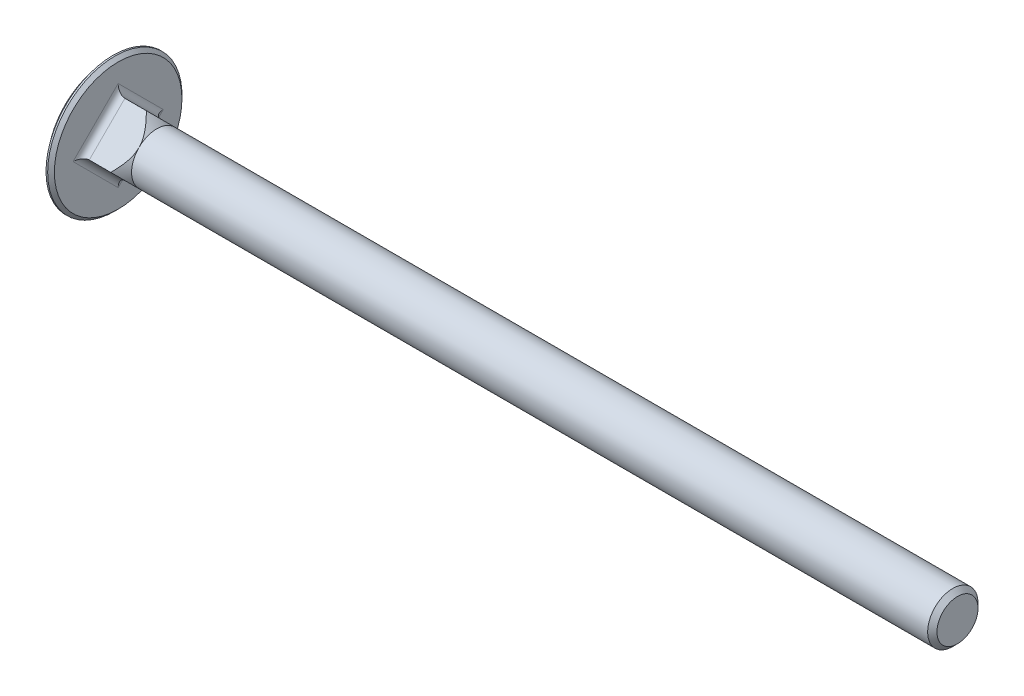
ISO-10303-21;
HEADER;
FILE_DESCRIPTION(('STEP AP214'),'2;1');
FILE_NAME('part.step','',(''),(''),'','','');
FILE_SCHEMA(('AUTOMOTIVE_DESIGN { 1 0 10303 214 1 1 1 1 }'));
ENDSEC;
DATA;
#1=APPLICATION_CONTEXT('core data for automotive mechanical design processes');
#2=APPLICATION_PROTOCOL_DEFINITION('international standard','automotive_design',2000,#1);
#3=PRODUCT_CONTEXT('',#1,'mechanical');
#4=PRODUCT('Part','Part','',(#3));
#5=PRODUCT_RELATED_PRODUCT_CATEGORY('part','',(#4));
#6=PRODUCT_DEFINITION_FORMATION('','',#4);
#7=PRODUCT_DEFINITION_CONTEXT('part definition',#1,'design');
#8=PRODUCT_DEFINITION('design','',#6,#7);
#9=PRODUCT_DEFINITION_SHAPE('','',#8);
#10=(LENGTH_UNIT() NAMED_UNIT(*) SI_UNIT(.MILLI.,.METRE.));
#11=(NAMED_UNIT(*) PLANE_ANGLE_UNIT() SI_UNIT($,.RADIAN.));
#12=(NAMED_UNIT(*) SI_UNIT($,.STERADIAN.) SOLID_ANGLE_UNIT());
#13=UNCERTAINTY_MEASURE_WITH_UNIT(LENGTH_MEASURE(1.E-05),#10,'distance_accuracy_value','');
#14=(GEOMETRIC_REPRESENTATION_CONTEXT(3) GLOBAL_UNCERTAINTY_ASSIGNED_CONTEXT((#13)) GLOBAL_UNIT_ASSIGNED_CONTEXT((#10,
#11,#12)) REPRESENTATION_CONTEXT('',''));
#15=CARTESIAN_POINT('',(0.,0.,0.));
#16=DIRECTION('',(0.,0.,1.));
#17=DIRECTION('',(1.,0.,0.));
#18=AXIS2_PLACEMENT_3D('',#15,#16,#17);
#19=CARTESIAN_POINT('',(-31.75,0.,0.));
#20=DIRECTION('',(-1.,0.,0.));
#21=DIRECTION('',(0.,0.,1.));
#22=AXIS2_PLACEMENT_3D('',#19,#20,#21);
#23=CYLINDRICAL_SURFACE('',#22,2.99999999999999);
#24=CARTESIAN_POINT('',(8.2,0.,0.));
#25=DIRECTION('',(-1.,0.,0.));
#26=DIRECTION('',(0.,0.,1.));
#27=AXIS2_PLACEMENT_3D('',#24,#25,#26);
#28=CIRCLE('',#27,2.99999999999999);
#29=CARTESIAN_POINT('',(8.2,2.12132034355964,2.12132034355964));
#30=VERTEX_POINT('',#29);
#31=CARTESIAN_POINT('',(8.2,-2.12132034355964,2.12132034355964));
#32=VERTEX_POINT('',#31);
#33=EDGE_CURVE('E122',#30,#32,#28,.F.);
#34=ORIENTED_EDGE('',*,*,#33,.T.);
#35=CARTESIAN_POINT('',(8.2,-2.12132034355964,-2.12132034355964));
#36=VERTEX_POINT('',#35);
#37=EDGE_CURVE('E131',#32,#36,#28,.F.);
#38=ORIENTED_EDGE('',*,*,#37,.T.);
#39=CARTESIAN_POINT('',(8.2,2.12132034355964,-2.12132034355964));
#40=VERTEX_POINT('',#39);
#41=EDGE_CURVE('E134',#36,#40,#28,.F.);
#42=ORIENTED_EDGE('',*,*,#41,.T.);
#43=EDGE_CURVE('E108',#40,#30,#28,.F.);
#44=ORIENTED_EDGE('',*,*,#43,.T.);
#45=EDGE_LOOP('',(#34,#38,#42,#44));
#46=FACE_BOUND('',#45,.T.);
#47=CARTESIAN_POINT('',(103.0455,0.,0.));
#48=DIRECTION('',(-1.,0.,0.));
#49=DIRECTION('',(0.,0.,1.));
#50=AXIS2_PLACEMENT_3D('',#47,#48,#49);
#51=CIRCLE('',#50,2.99999999999998);
#52=CARTESIAN_POINT('',(103.0455,0.,2.99999999999998));
#53=VERTEX_POINT('',#52);
#54=EDGE_CURVE('E259',#53,#53,#51,.T.);
#55=ORIENTED_EDGE('',*,*,#54,.T.);
#56=EDGE_LOOP('',(#55));
#57=FACE_BOUND('',#56,.T.);
#58=ADVANCED_FACE('F36',(#46,#57),#23,.T.);
#59=CARTESIAN_POINT('',(103.6,2.4455,0.));
#60=DIRECTION('',(1.,0.,0.));
#61=DIRECTION('',(0.,0.,-1.));
#62=AXIS2_PLACEMENT_3D('',#59,#60,#61);
#63=PLANE('',#62);
#64=CARTESIAN_POINT('',(103.6,0.,0.));
#65=DIRECTION('',(-1.,0.,0.));
#66=DIRECTION('',(0.,0.,1.));
#67=AXIS2_PLACEMENT_3D('',#64,#65,#66);
#68=CIRCLE('',#67,2.4455);
#69=CARTESIAN_POINT('',(103.6,0.,2.4455));
#70=VERTEX_POINT('',#69);
#71=EDGE_CURVE('E129',#70,#70,#68,.T.);
#72=ORIENTED_EDGE('',*,*,#71,.F.);
#73=EDGE_LOOP('',(#72));
#74=FACE_BOUND('',#73,.T.);
#75=ADVANCED_FACE('F193',(#74),#63,.T.);
#76=CARTESIAN_POINT('',(103.6,0.,0.));
#77=DIRECTION('',(-1.,0.,0.));
#78=DIRECTION('',(0.,0.,1.));
#79=AXIS2_PLACEMENT_3D('',#76,#77,#78);
#80=CONICAL_SURFACE('',#79,2.4455,0.785398163397422);
#81=ORIENTED_EDGE('',*,*,#54,.F.);
#82=EDGE_LOOP('',(#81));
#83=FACE_BOUND('',#82,.T.);
#84=ORIENTED_EDGE('',*,*,#71,.T.);
#85=EDGE_LOOP('',(#84));
#86=FACE_BOUND('',#85,.T.);
#87=ADVANCED_FACE('F198',(#83,#86),#80,.T.);
#88=CARTESIAN_POINT('',(2.20000000000002,0.,0.));
#89=DIRECTION('',(-1.,0.,0.));
#90=DIRECTION('',(0.,0.,1.));
#91=AXIS2_PLACEMENT_3D('',#88,#89,#90);
#92=CONICAL_SURFACE('',#91,9.,0.78539816339745);
#93=CARTESIAN_POINT('',(6.95715930816689,4.24284068711929,-0.000199999999999571));
#94=CARTESIAN_POINT('',(7.01643460291272,4.18354884947332,0.0590918376459672));
#95=CARTESIAN_POINT('',(7.07491232269781,4.123849261009,0.118791426110286));
#96=CARTESIAN_POINT('',(7.18989092946537,4.00346812939192,0.239172557727362));
#97=CARTESIAN_POINT('',(7.24639091590675,3.94278615684913,0.299854530270156));
#98=CARTESIAN_POINT('',(7.35766892755164,3.81956214384989,0.423078543269395));
#99=CARTESIAN_POINT('',(7.41241663337786,3.75700633775018,0.485634349369109));
#100=CARTESIAN_POINT('',(7.51886023106645,3.63061648575001,0.612024201369276));
#101=CARTESIAN_POINT('',(7.57055647160103,3.56678258700996,0.675858100109321));
#102=CARTESIAN_POINT('',(7.67174666983998,3.43562527527377,0.807015411845515));
#103=CARTESIAN_POINT('',(7.72112124590263,3.36825515972747,0.874385527391819));
#104=CARTESIAN_POINT('',(7.81485548466575,3.23180100313267,1.01083968398662));
#105=CARTESIAN_POINT('',(7.85921419481978,3.16271663956453,1.07992404755475));
#106=CARTESIAN_POINT('',(7.98248355046365,2.95331308578628,1.289327601333));
#107=CARTESIAN_POINT('',(8.05222972729531,2.81005176209045,1.43258892502884));
#108=CARTESIAN_POINT('',(8.12780049193547,2.59430729463026,1.64833339248902));
#109=CARTESIAN_POINT('',(8.14794262242049,2.52430014494078,1.7183405421785));
#110=CARTESIAN_POINT('',(8.17882887308437,2.38321062880929,1.85943005831));
#111=CARTESIAN_POINT('',(8.18957094130362,2.3121280310487,1.93051265607058));
#112=CARTESIAN_POINT('',(8.2008334522612,2.17055574380496,2.07208494331433));
#113=CARTESIAN_POINT('',(8.20149522498811,2.10007173273608,2.1425689543832));
#114=CARTESIAN_POINT('',(8.19291620035083,1.95941037804252,2.28323030907676));
#115=CARTESIAN_POINT('',(8.18367535606004,1.88923303587267,2.35340765124662));
#116=CARTESIAN_POINT('',(8.15600584917316,1.75030558303287,2.49233510408642));
#117=CARTESIAN_POINT('',(8.13764150446671,1.68154894205988,2.56109174505941));
#118=CARTESIAN_POINT('',(8.09279890784268,1.54534927741958,2.69729140969971));
#119=CARTESIAN_POINT('',(8.06631574532425,1.47790707510901,2.76473361201027));
#120=CARTESIAN_POINT('',(8.00608482010148,1.34372760816381,2.89891307895547));
#121=CARTESIAN_POINT('',(7.97224787918966,1.27701061273304,2.96563007438625));
#122=CARTESIAN_POINT('',(7.89876080414648,1.14522797402158,3.0974127130977));
#123=CARTESIAN_POINT('',(7.85911151529404,1.08016209223388,3.16247859488541));
#124=CARTESIAN_POINT('',(7.75757568127071,0.924792870769788,3.3178478163495));
#125=CARTESIAN_POINT('',(7.69330756858018,0.835271153647686,3.4073695334716));
#126=CARTESIAN_POINT('',(7.55770456538748,0.658912920654168,3.58372776646512));
#127=CARTESIAN_POINT('',(7.48636507333269,0.572078202151462,3.67056248496782));
#128=CARTESIAN_POINT('',(7.34065654968733,0.403299846098274,3.83934084102101));
#129=CARTESIAN_POINT('',(7.26644512123752,0.321287746779483,3.9213529403398));
#130=CARTESIAN_POINT('',(7.15234645891491,0.199689955696817,4.04295073142247));
#131=CARTESIAN_POINT('',(7.11388489137572,0.159428733989405,4.08321195312988));
#132=CARTESIAN_POINT('',(7.03612441479246,0.0793171961942268,4.16332349092506));
#133=CARTESIAN_POINT('',(6.99682557385314,0.0394668470739558,4.20317384004533));
#134=CARTESIAN_POINT('',(6.95715930816689,-0.00020000000000077,4.24284068711929));
#135=B_SPLINE_CURVE_WITH_KNOTS('',3,(#93,#94,#95,#96,#97,#98,#99,#100,#101,#102,#103,#104,#105,
#106,#107,#108,#109,#110,#111,#112,#113,#114,#115,#116,#117,#118,#119,#120,#121,#122,#123,#124,
#125,#126,#127,#128,#129,#130,#131,#132,#133,#134),.UNSPECIFIED.,.F.,.F.,(4,2,2,2,2,2,2,2,2,2,2,
2,2,2,2,2,2,2,2,2,4),(0.,0.308071452286483,0.616281403837969,0.928340708616832,1.24036428699253,
1.56214294853695,1.88398261573137,2.52380770468371,2.82653854831693,3.1293354592375,
3.42788305930369,3.72643207413549,4.02290565428026,4.31955890903334,4.62003321839452,
4.92046387360824,5.3460850582516,5.77198504828632,6.18496220263305,6.39108995770356,
6.59720100964495),.UNSPECIFIED.);
#136=CARTESIAN_POINT('',(6.95735931288072,0.,4.24264068711929));
#137=VERTEX_POINT('',#136);
#138=EDGE_CURVE('E117',#30,#137,#135,.T.);
#139=ORIENTED_EDGE('',*,*,#138,.T.);
#140=CARTESIAN_POINT('',(6.95715930816689,0.000199999999999906,4.24284068711929));
#141=CARTESIAN_POINT('',(7.01643460291272,-0.0590918376459671,4.18354884947332));
#142=CARTESIAN_POINT('',(7.07491232269781,-0.118791426110286,4.123849261009));
#143=CARTESIAN_POINT('',(7.18989092946537,-0.239172557727362,4.00346812939192));
#144=CARTESIAN_POINT('',(7.24639091590675,-0.299854530270155,3.94278615684913));
#145=CARTESIAN_POINT('',(7.35766892755164,-0.423078543269395,3.81956214384989));
#146=CARTESIAN_POINT('',(7.41241663337786,-0.485634349369109,3.75700633775018));
#147=CARTESIAN_POINT('',(7.51886023106644,-0.612024201369276,3.63061648575001));
#148=CARTESIAN_POINT('',(7.57055647160103,-0.675858100109322,3.56678258700996));
#149=CARTESIAN_POINT('',(7.67174666983998,-0.807015411845515,3.43562527527377));
#150=CARTESIAN_POINT('',(7.72112124590263,-0.874385527391819,3.36825515972747));
#151=CARTESIAN_POINT('',(7.81485548466575,-1.01083968398662,3.23180100313266));
#152=CARTESIAN_POINT('',(7.85921419481978,-1.07992404755475,3.16271663956453));
#153=CARTESIAN_POINT('',(7.98248355046365,-1.289327601333,2.95331308578628));
#154=CARTESIAN_POINT('',(8.05222972729531,-1.43258892502884,2.81005176209045));
#155=CARTESIAN_POINT('',(8.12780049193547,-1.64833339248902,2.59430729463026));
#156=CARTESIAN_POINT('',(8.14794262242049,-1.7183405421785,2.52430014494078));
#157=CARTESIAN_POINT('',(8.17882887308437,-1.85943005831,2.38321062880929));
#158=CARTESIAN_POINT('',(8.18957094130362,-1.93051265607058,2.3121280310487));
#159=CARTESIAN_POINT('',(8.2008334522612,-2.07208494331433,2.17055574380496));
#160=CARTESIAN_POINT('',(8.20149522498811,-2.1425689543832,2.10007173273608));
#161=CARTESIAN_POINT('',(8.19291620035083,-2.28323030907676,1.95941037804252));
#162=CARTESIAN_POINT('',(8.18367535606004,-2.35340765124662,1.88923303587267));
#163=CARTESIAN_POINT('',(8.15600584917316,-2.49233510408642,1.75030558303287));
#164=CARTESIAN_POINT('',(8.13764150446671,-2.56109174505941,1.68154894205988));
#165=CARTESIAN_POINT('',(8.09279890784268,-2.69729140969971,1.54534927741958));
#166=CARTESIAN_POINT('',(8.06631574532425,-2.76473361201027,1.47790707510901));
#167=CARTESIAN_POINT('',(8.00608482010148,-2.89891307895547,1.34372760816382));
#168=CARTESIAN_POINT('',(7.97224787918966,-2.96563007438625,1.27701061273304));
#169=CARTESIAN_POINT('',(7.89876080414648,-3.0974127130977,1.14522797402158));
#170=CARTESIAN_POINT('',(7.85911151529404,-3.16247859488541,1.08016209223388));
#171=CARTESIAN_POINT('',(7.75757568127071,-3.3178478163495,0.924792870769789));
#172=CARTESIAN_POINT('',(7.69330756858018,-3.4073695334716,0.835271153647687));
#173=CARTESIAN_POINT('',(7.55770456538749,-3.58372776646512,0.658912920654169));
#174=CARTESIAN_POINT('',(7.48636507333269,-3.67056248496782,0.572078202151462));
#175=CARTESIAN_POINT('',(7.34065654968733,-3.83934084102101,0.403299846098275));
#176=CARTESIAN_POINT('',(7.26644512123752,-3.9213529403398,0.321287746779484));
#177=CARTESIAN_POINT('',(7.15234645891491,-4.04295073142247,0.199689955696818));
#178=CARTESIAN_POINT('',(7.11388489137572,-4.08321195312988,0.159428733989406));
#179=CARTESIAN_POINT('',(7.03612441479246,-4.16332349092506,0.0793171961942277));
#180=CARTESIAN_POINT('',(6.99682557385314,-4.20317384004533,0.0394668470739564));
#181=CARTESIAN_POINT('',(6.95715930816689,-4.24284068711929,-0.000199999999999621));
#182=B_SPLINE_CURVE_WITH_KNOTS('',3,(#140,#141,#142,#143,#144,#145,#146,#147,#148,#149,#150,
#151,#152,#153,#154,#155,#156,#157,#158,#159,#160,#161,#162,#163,#164,#165,#166,#167,#168,#169,
#170,#171,#172,#173,#174,#175,#176,#177,#178,#179,#180,#181),.UNSPECIFIED.,.F.,.F.,(4,2,2,2,2,2,
2,2,2,2,2,2,2,2,2,2,2,2,2,2,4),(0.,0.308071452286484,0.61628140383797,0.928340708616833,
1.24036428699253,1.56214294853696,1.88398261573137,2.52380770468371,2.82653854831693,
3.1293354592375,3.42788305930369,3.72643207413549,4.02290565428026,4.31955890903334,
4.62003321839452,4.92046387360824,5.34608505825161,5.77198504828632,6.18496220263305,
6.39108995770356,6.59720100964495),.UNSPECIFIED.);
#183=EDGE_CURVE('E125',#137,#32,#182,.T.);
#184=ORIENTED_EDGE('',*,*,#183,.T.);
#185=ORIENTED_EDGE('',*,*,#33,.F.);
#186=EDGE_LOOP('',(#139,#184,#185));
#187=FACE_BOUND('',#186,.T.);
#188=ADVANCED_FACE('F123',(#187),#92,.T.);
#189=CARTESIAN_POINT('',(6.95735931288072,4.24264068711929,0.));
#190=VERTEX_POINT('',#189);
#191=EDGE_CURVE('E104',#190,#30,#135,.T.);
#192=ORIENTED_EDGE('',*,*,#191,.T.);
#193=ORIENTED_EDGE('',*,*,#43,.F.);
#194=CARTESIAN_POINT('',(6.95715930816689,-0.000200000000000094,-4.24284068711929));
#195=CARTESIAN_POINT('',(7.01643460291272,0.0590918376459666,-4.18354884947332));
#196=CARTESIAN_POINT('',(7.07491232269781,0.118791426110285,-4.123849261009));
#197=CARTESIAN_POINT('',(7.18989092946537,0.239172557727361,-4.00346812939192));
#198=CARTESIAN_POINT('',(7.24639091590675,0.299854530270155,-3.94278615684913));
#199=CARTESIAN_POINT('',(7.35766892755164,0.423078543269394,-3.81956214384989));
#200=CARTESIAN_POINT('',(7.41241663337786,0.485634349369109,-3.75700633775018));
#201=CARTESIAN_POINT('',(7.51886023106645,0.612024201369276,-3.63061648575001));
#202=CARTESIAN_POINT('',(7.57055647160103,0.675858100109321,-3.56678258700996));
#203=CARTESIAN_POINT('',(7.67174666983998,0.807015411845515,-3.43562527527377));
#204=CARTESIAN_POINT('',(7.72112124590263,0.874385527391819,-3.36825515972747));
#205=CARTESIAN_POINT('',(7.81485548466575,1.01083968398662,-3.23180100313267));
#206=CARTESIAN_POINT('',(7.85921419481978,1.07992404755475,-3.16271663956453));
#207=CARTESIAN_POINT('',(7.98248355046365,1.289327601333,-2.95331308578628));
#208=CARTESIAN_POINT('',(8.05222972729531,1.43258892502884,-2.81005176209045));
#209=CARTESIAN_POINT('',(8.12780049193547,1.64833339248902,-2.59430729463026));
#210=CARTESIAN_POINT('',(8.14794262242049,1.7183405421785,-2.52430014494078));
#211=CARTESIAN_POINT('',(8.17882887308437,1.85943005831,-2.38321062880929));
#212=CARTESIAN_POINT('',(8.18957094130362,1.93051265607058,-2.3121280310487));
#213=CARTESIAN_POINT('',(8.2008334522612,2.07208494331433,-2.17055574380496));
#214=CARTESIAN_POINT('',(8.20149522498811,2.1425689543832,-2.10007173273608));
#215=CARTESIAN_POINT('',(8.19291620035083,2.28323030907676,-1.95941037804252));
#216=CARTESIAN_POINT('',(8.18367535606004,2.35340765124662,-1.88923303587267));
#217=CARTESIAN_POINT('',(8.15600584917316,2.49233510408642,-1.75030558303287));
#218=CARTESIAN_POINT('',(8.13764150446671,2.56109174505941,-1.68154894205988));
#219=CARTESIAN_POINT('',(8.09279890784268,2.69729140969971,-1.54534927741958));
#220=CARTESIAN_POINT('',(8.06631574532425,2.76473361201027,-1.47790707510901));
#221=CARTESIAN_POINT('',(8.00608482010149,2.89891307895547,-1.34372760816381));
#222=CARTESIAN_POINT('',(7.97224787918966,2.96563007438625,-1.27701061273304));
#223=CARTESIAN_POINT('',(7.89876080414648,3.0974127130977,-1.14522797402158));
#224=CARTESIAN_POINT('',(7.85911151529403,3.16247859488541,-1.08016209223388));
#225=CARTESIAN_POINT('',(7.75757568127071,3.3178478163495,-0.924792870769789));
#226=CARTESIAN_POINT('',(7.69330756858018,3.4073695334716,-0.835271153647686));
#227=CARTESIAN_POINT('',(7.55770456538748,3.58372776646512,-0.658912920654168));
#228=CARTESIAN_POINT('',(7.48636507333269,3.67056248496782,-0.572078202151461));
#229=CARTESIAN_POINT('',(7.34065654968733,3.83934084102101,-0.403299846098274));
#230=CARTESIAN_POINT('',(7.26644512123752,3.9213529403398,-0.321287746779484));
#231=CARTESIAN_POINT('',(7.15234645891491,4.04295073142247,-0.199689955696818));
#232=CARTESIAN_POINT('',(7.11388489137572,4.08321195312988,-0.159428733989406));
#233=CARTESIAN_POINT('',(7.03612441479246,4.16332349092506,-0.0793171961942274));
#234=CARTESIAN_POINT('',(6.99682557385314,4.20317384004533,-0.0394668470739563));
#235=CARTESIAN_POINT('',(6.95715930816689,4.24284068711929,0.000199999999999894));
#236=B_SPLINE_CURVE_WITH_KNOTS('',3,(#194,#195,#196,#197,#198,#199,#200,#201,#202,#203,#204,
#205,#206,#207,#208,#209,#210,#211,#212,#213,#214,#215,#216,#217,#218,#219,#220,#221,#222,#223,
#224,#225,#226,#227,#228,#229,#230,#231,#232,#233,#234,#235),.UNSPECIFIED.,.F.,.F.,(4,2,2,2,2,2,
2,2,2,2,2,2,2,2,2,2,2,2,2,2,4),(0.,0.308071452286483,0.616281403837969,0.928340708616832,
1.24036428699253,1.56214294853696,1.88398261573137,2.52380770468371,2.82653854831693,
3.1293354592375,3.42788305930369,3.72643207413549,4.02290565428026,4.31955890903334,
4.62003321839452,4.92046387360824,5.34608505825161,5.77198504828632,6.18496220263305,
6.39108995770356,6.59720100964495),.UNSPECIFIED.);
#237=EDGE_CURVE('E111',#40,#190,#236,.T.);
#238=ORIENTED_EDGE('',*,*,#237,.T.);
#239=EDGE_LOOP('',(#192,#193,#238));
#240=FACE_BOUND('',#239,.T.);
#241=ADVANCED_FACE('F106',(#240),#92,.T.);
#242=CARTESIAN_POINT('',(6.95715930816689,-4.24284068711929,0.00019999999999968));
#243=CARTESIAN_POINT('',(7.01643460291272,-4.18354884947332,-0.0590918376459669));
#244=CARTESIAN_POINT('',(7.07491232269781,-4.123849261009,-0.118791426110286));
#245=CARTESIAN_POINT('',(7.18989092946537,-4.00346812939192,-0.239172557727362));
#246=CARTESIAN_POINT('',(7.24639091590675,-3.94278615684913,-0.299854530270156));
#247=CARTESIAN_POINT('',(7.35766892755165,-3.81956214384989,-0.423078543269395));
#248=CARTESIAN_POINT('',(7.41241663337786,-3.75700633775018,-0.485634349369109));
#249=CARTESIAN_POINT('',(7.51886023106645,-3.63061648575001,-0.612024201369276));
#250=CARTESIAN_POINT('',(7.57055647160104,-3.56678258700996,-0.675858100109322));
#251=CARTESIAN_POINT('',(7.67174666983998,-3.43562527527377,-0.807015411845516));
#252=CARTESIAN_POINT('',(7.72112124590263,-3.36825515972747,-0.87438552739182));
#253=CARTESIAN_POINT('',(7.81485548466575,-3.23180100313266,-1.01083968398662));
#254=CARTESIAN_POINT('',(7.85921419481978,-3.16271663956453,-1.07992404755475));
#255=CARTESIAN_POINT('',(7.98248355046365,-2.95331308578628,-1.289327601333));
#256=CARTESIAN_POINT('',(8.05222972729531,-2.81005176209045,-1.43258892502884));
#257=CARTESIAN_POINT('',(8.12780049193547,-2.59430729463026,-1.64833339248902));
#258=CARTESIAN_POINT('',(8.14794262242049,-2.52430014494078,-1.7183405421785));
#259=CARTESIAN_POINT('',(8.17882887308437,-2.38321062880929,-1.85943005831));
#260=CARTESIAN_POINT('',(8.18957094130362,-2.3121280310487,-1.93051265607058));
#261=CARTESIAN_POINT('',(8.2008334522612,-2.17055574380496,-2.07208494331433));
#262=CARTESIAN_POINT('',(8.20149522498811,-2.10007173273608,-2.1425689543832));
#263=CARTESIAN_POINT('',(8.19291620035082,-1.95941037804252,-2.28323030907676));
#264=CARTESIAN_POINT('',(8.18367535606004,-1.88923303587267,-2.35340765124662));
#265=CARTESIAN_POINT('',(8.15600584917316,-1.75030558303287,-2.49233510408642));
#266=CARTESIAN_POINT('',(8.13764150446671,-1.68154894205988,-2.56109174505941));
#267=CARTESIAN_POINT('',(8.09279890784268,-1.54534927741958,-2.69729140969971));
#268=CARTESIAN_POINT('',(8.06631574532425,-1.47790707510901,-2.76473361201027));
#269=CARTESIAN_POINT('',(8.00608482010148,-1.34372760816382,-2.89891307895547));
#270=CARTESIAN_POINT('',(7.97224787918966,-1.27701061273304,-2.96563007438625));
#271=CARTESIAN_POINT('',(7.89876080414648,-1.14522797402158,-3.0974127130977));
#272=CARTESIAN_POINT('',(7.85911151529404,-1.08016209223388,-3.16247859488541));
#273=CARTESIAN_POINT('',(7.75757568127071,-0.92479287076979,-3.3178478163495));
#274=CARTESIAN_POINT('',(7.69330756858018,-0.835271153647687,-3.4073695334716));
#275=CARTESIAN_POINT('',(7.55770456538749,-0.658912920654169,-3.58372776646512));
#276=CARTESIAN_POINT('',(7.48636507333269,-0.572078202151462,-3.67056248496782));
#277=CARTESIAN_POINT('',(7.34065654968733,-0.403299846098275,-3.83934084102101));
#278=CARTESIAN_POINT('',(7.26644512123752,-0.321287746779484,-3.9213529403398));
#279=CARTESIAN_POINT('',(7.15234645891491,-0.199689955696818,-4.04295073142247));
#280=CARTESIAN_POINT('',(7.11388489137572,-0.159428733989406,-4.08321195312988));
#281=CARTESIAN_POINT('',(7.03612441479246,-0.0793171961942273,-4.16332349092506));
#282=CARTESIAN_POINT('',(6.99682557385314,-0.0394668470739561,-4.20317384004533));
#283=CARTESIAN_POINT('',(6.95715930816689,0.000200000000000131,-4.24284068711929));
#284=B_SPLINE_CURVE_WITH_KNOTS('',3,(#242,#243,#244,#245,#246,#247,#248,#249,#250,#251,#252,
#253,#254,#255,#256,#257,#258,#259,#260,#261,#262,#263,#264,#265,#266,#267,#268,#269,#270,#271,
#272,#273,#274,#275,#276,#277,#278,#279,#280,#281,#282,#283),.UNSPECIFIED.,.F.,.F.,(4,2,2,2,2,2,
2,2,2,2,2,2,2,2,2,2,2,2,2,2,4),(0.,0.308071452286484,0.61628140383797,0.928340708616833,
1.24036428699253,1.56214294853696,1.88398261573137,2.52380770468371,2.82653854831693,
3.1293354592375,3.42788305930369,3.72643207413549,4.02290565428026,4.31955890903334,
4.62003321839452,4.92046387360824,5.3460850582516,5.77198504828632,6.18496220263305,
6.39108995770357,6.59720100964495),.UNSPECIFIED.);
#285=CARTESIAN_POINT('',(6.95735931288072,0.,-4.24264068711929));
#286=VERTEX_POINT('',#285);
#287=EDGE_CURVE('E176',#36,#286,#284,.T.);
#288=ORIENTED_EDGE('',*,*,#287,.T.);
#289=EDGE_CURVE('E182',#286,#40,#236,.T.);
#290=ORIENTED_EDGE('',*,*,#289,.T.);
#291=ORIENTED_EDGE('',*,*,#41,.F.);
#292=EDGE_LOOP('',(#288,#290,#291));
#293=FACE_BOUND('',#292,.T.);
#294=ADVANCED_FACE('F163',(#293),#92,.T.);
#295=CARTESIAN_POINT('',(6.95735931288072,-4.24264068711929,0.));
#296=VERTEX_POINT('',#295);
#297=EDGE_CURVE('E139',#32,#296,#182,.T.);
#298=ORIENTED_EDGE('',*,*,#297,.T.);
#299=EDGE_CURVE('E181',#296,#36,#284,.T.);
#300=ORIENTED_EDGE('',*,*,#299,.T.);
#301=ORIENTED_EDGE('',*,*,#37,.F.);
#302=EDGE_LOOP('',(#298,#300,#301));
#303=FACE_BOUND('',#302,.T.);
#304=ADVANCED_FACE('F276',(#303),#92,.T.);
#305=CARTESIAN_POINT('',(3.6,8.,0.));
#306=DIRECTION('',(1.,0.,0.));
#307=DIRECTION('',(0.,0.,-1.));
#308=AXIS2_PLACEMENT_3D('',#305,#306,#307);
#309=PLANE('',#308);
#310=DIRECTION('',(0.,0.707106781186548,0.707106781186548));
#311=VECTOR('',#310,1.);
#312=CARTESIAN_POINT('',(3.6,1.31299423149112,6.68700576850888));
#313=LINE('',#312,#311);
#314=CARTESIAN_POINT('',(3.6,-5.37401153701776,0.));
#315=VERTEX_POINT('',#314);
#316=CARTESIAN_POINT('',(3.6,0.,5.37401153701776));
#317=VERTEX_POINT('',#316);
#318=EDGE_CURVE('E229',#315,#317,#313,.T.);
#319=ORIENTED_EDGE('',*,*,#318,.T.);
#320=DIRECTION('',(0.,0.707106781186548,-0.707106781186548));
#321=VECTOR('',#320,1.);
#322=CARTESIAN_POINT('',(3.6,6.68700576850888,-1.31299423149112));
#323=LINE('',#322,#321);
#324=CARTESIAN_POINT('',(3.6,5.37401153701776,0.));
#325=VERTEX_POINT('',#324);
#326=EDGE_CURVE('E249',#317,#325,#323,.T.);
#327=ORIENTED_EDGE('',*,*,#326,.T.);
#328=DIRECTION('',(0.,-0.707106781186548,-0.707106781186548));
#329=VECTOR('',#328,1.);
#330=CARTESIAN_POINT('',(3.6,6.68700576850888,1.31299423149112));
#331=LINE('',#330,#329);
#332=CARTESIAN_POINT('',(3.6,0.,-5.37401153701776));
#333=VERTEX_POINT('',#332);
#334=EDGE_CURVE('E255',#325,#333,#331,.T.);
#335=ORIENTED_EDGE('',*,*,#334,.T.);
#336=DIRECTION('',(0.,-0.707106781186548,0.707106781186548));
#337=VECTOR('',#336,1.);
#338=CARTESIAN_POINT('',(3.6,1.31299423149112,-6.68700576850888));
#339=LINE('',#338,#337);
#340=EDGE_CURVE('E253',#333,#315,#339,.T.);
#341=ORIENTED_EDGE('',*,*,#340,.T.);
#342=EDGE_LOOP('',(#319,#327,#335,#341));
#343=FACE_BOUND('',#342,.T.);
#344=CARTESIAN_POINT('',(3.6,0.,0.));
#345=DIRECTION('',(1.,0.,0.));
#346=DIRECTION('',(0.,0.,-1.));
#347=AXIS2_PLACEMENT_3D('',#344,#345,#346);
#348=CIRCLE('',#347,7.60000000000002);
#349=CARTESIAN_POINT('',(3.6,0.,-7.60000000000002));
#350=VERTEX_POINT('',#349);
#351=EDGE_CURVE('E231',#350,#350,#348,.T.);
#352=ORIENTED_EDGE('',*,*,#351,.T.);
#353=EDGE_LOOP('',(#352));
#354=FACE_BOUND('',#353,.T.);
#355=ADVANCED_FACE('F203',(#343,#354),#309,.T.);
#356=CARTESIAN_POINT('',(8.2,4.24264068711929,0.));
#357=DIRECTION('',(0.,-0.707106781186547,0.707106781186547));
#358=DIRECTION('',(0.,-0.707106781186548,-0.707106781186548));
#359=AXIS2_PLACEMENT_3D('',#356,#357,#358);
#360=PLANE('',#359);
#361=DIRECTION('',(-1.,0.,0.));
#362=VECTOR('',#361,1.);
#363=CARTESIAN_POINT('',(8.2,0.,-4.24264068711929));
#364=LINE('',#363,#362);
#365=CARTESIAN_POINT('',(4.4,0.,-4.24264068711929));
#366=VERTEX_POINT('',#365);
#367=EDGE_CURVE('E267',#286,#366,#364,.T.);
#368=ORIENTED_EDGE('',*,*,#367,.T.);
#369=DIRECTION('',(0.,-0.707106781186548,-0.707106781186548));
#370=VECTOR('',#369,1.);
#371=CARTESIAN_POINT('',(4.4,4.24264068711929,0.));
#372=LINE('',#371,#370);
#373=CARTESIAN_POINT('',(4.4,4.24264068711929,0.));
#374=VERTEX_POINT('',#373);
#375=EDGE_CURVE('E12',#366,#374,#372,.F.);
#376=ORIENTED_EDGE('',*,*,#375,.T.);
#377=DIRECTION('',(-1.,0.,0.));
#378=VECTOR('',#377,1.);
#379=CARTESIAN_POINT('',(8.2,4.24264068711929,0.));
#380=LINE('',#379,#378);
#381=EDGE_CURVE('E116',#190,#374,#380,.T.);
#382=ORIENTED_EDGE('',*,*,#381,.F.);
#383=ORIENTED_EDGE('',*,*,#237,.F.);
#384=ORIENTED_EDGE('',*,*,#289,.F.);
#385=EDGE_LOOP('',(#368,#376,#382,#383,#384));
#386=FACE_BOUND('',#385,.T.);
#387=ADVANCED_FACE('F164',(#386),#360,.F.);
#388=CARTESIAN_POINT('',(8.2,0.,-4.24264068711929));
#389=DIRECTION('',(0.,0.707106781186547,0.707106781186547));
#390=DIRECTION('',(0.,-0.707106781186548,0.707106781186548));
#391=AXIS2_PLACEMENT_3D('',#388,#389,#390);
#392=PLANE('',#391);
#393=DIRECTION('',(-1.,0.,0.));
#394=VECTOR('',#393,1.);
#395=CARTESIAN_POINT('',(8.2,-4.24264068711929,0.));
#396=LINE('',#395,#394);
#397=CARTESIAN_POINT('',(4.4,-4.24264068711929,0.));
#398=VERTEX_POINT('',#397);
#399=EDGE_CURVE('E266',#296,#398,#396,.T.);
#400=ORIENTED_EDGE('',*,*,#399,.T.);
#401=DIRECTION('',(0.,-0.707106781186548,0.707106781186548));
#402=VECTOR('',#401,1.);
#403=CARTESIAN_POINT('',(4.4,0.,-4.24264068711929));
#404=LINE('',#403,#402);
#405=EDGE_CURVE('E45',#398,#366,#404,.F.);
#406=ORIENTED_EDGE('',*,*,#405,.T.);
#407=ORIENTED_EDGE('',*,*,#367,.F.);
#408=ORIENTED_EDGE('',*,*,#287,.F.);
#409=ORIENTED_EDGE('',*,*,#299,.F.);
#410=EDGE_LOOP('',(#400,#406,#407,#408,#409));
#411=FACE_BOUND('',#410,.T.);
#412=ADVANCED_FACE('F183',(#411),#392,.F.);
#413=CARTESIAN_POINT('',(8.2,-4.24264068711929,0.));
#414=DIRECTION('',(0.,0.707106781186547,-0.707106781186547));
#415=DIRECTION('',(0.,0.707106781186548,0.707106781186548));
#416=AXIS2_PLACEMENT_3D('',#413,#414,#415);
#417=PLANE('',#416);
#418=DIRECTION('',(-1.,0.,0.));
#419=VECTOR('',#418,1.);
#420=CARTESIAN_POINT('',(8.2,0.,4.24264068711929));
#421=LINE('',#420,#419);
#422=CARTESIAN_POINT('',(4.4,0.,4.24264068711929));
#423=VERTEX_POINT('',#422);
#424=EDGE_CURVE('E138',#137,#423,#421,.T.);
#425=ORIENTED_EDGE('',*,*,#424,.T.);
#426=DIRECTION('',(0.,0.707106781186548,0.707106781186548));
#427=VECTOR('',#426,1.);
#428=CARTESIAN_POINT('',(4.4,-4.24264068711929,0.));
#429=LINE('',#428,#427);
#430=EDGE_CURVE('E60',#423,#398,#429,.F.);
#431=ORIENTED_EDGE('',*,*,#430,.T.);
#432=ORIENTED_EDGE('',*,*,#399,.F.);
#433=ORIENTED_EDGE('',*,*,#297,.F.);
#434=ORIENTED_EDGE('',*,*,#183,.F.);
#435=EDGE_LOOP('',(#425,#431,#432,#433,#434));
#436=FACE_BOUND('',#435,.T.);
#437=ADVANCED_FACE('F186',(#436),#417,.F.);
#438=CARTESIAN_POINT('',(8.2,0.,4.24264068711929));
#439=DIRECTION('',(0.,-0.707106781186547,-0.707106781186547));
#440=DIRECTION('',(0.,0.707106781186548,-0.707106781186548));
#441=AXIS2_PLACEMENT_3D('',#438,#439,#440);
#442=PLANE('',#441);
#443=ORIENTED_EDGE('',*,*,#381,.T.);
#444=DIRECTION('',(0.,0.707106781186548,-0.707106781186548));
#445=VECTOR('',#444,1.);
#446=CARTESIAN_POINT('',(4.4,0.,4.24264068711929));
#447=LINE('',#446,#445);
#448=EDGE_CURVE('E247',#374,#423,#447,.F.);
#449=ORIENTED_EDGE('',*,*,#448,.T.);
#450=ORIENTED_EDGE('',*,*,#424,.F.);
#451=ORIENTED_EDGE('',*,*,#138,.F.);
#452=ORIENTED_EDGE('',*,*,#191,.F.);
#453=EDGE_LOOP('',(#443,#449,#450,#451,#452));
#454=FACE_BOUND('',#453,.T.);
#455=ADVANCED_FACE('F136',(#454),#442,.F.);
#456=CARTESIAN_POINT('',(3.20000000000002,0.,0.));
#457=DIRECTION('',(-1.,0.,0.));
#458=DIRECTION('',(0.,0.,1.));
#459=AXIS2_PLACEMENT_3D('',#456,#457,#458);
#460=CIRCLE('',#459,8.);
#461=CARTESIAN_POINT('',(3.20000000000002,0.,8.));
#462=VERTEX_POINT('',#461);
#463=EDGE_CURVE('E234',#462,#462,#460,.T.);
#464=ORIENTED_EDGE('',*,*,#463,.F.);
#465=EDGE_LOOP('',(#464));
#466=FACE_BOUND('',#465,.T.);
#467=ORIENTED_EDGE('',*,*,#351,.F.);
#468=EDGE_LOOP('',(#467));
#469=FACE_BOUND('',#468,.T.);
#470=ADVANCED_FACE('F157',(#466,#469),#92,.T.);
#471=CARTESIAN_POINT('',(12.1593401545431,0.,0.));
#472=DIRECTION('',(-1.,0.,0.));
#473=DIRECTION('',(0.,1.,0.));
#474=AXIS2_PLACEMENT_3D('',#471,#472,#473);
#475=SPHERICAL_SURFACE('',#474,12.1593401545431);
#476=CARTESIAN_POINT('',(3.0024,0.,0.));
#477=DIRECTION('',(-1.,0.,0.));
#478=DIRECTION('',(0.,0.,1.));
#479=AXIS2_PLACEMENT_3D('',#476,#477,#478);
#480=CIRCLE('',#479,8.);
#481=CARTESIAN_POINT('',(3.0024,0.,8.));
#482=VERTEX_POINT('',#481);
#483=EDGE_CURVE('E262',#482,#482,#480,.T.);
#484=ORIENTED_EDGE('',*,*,#483,.T.);
#485=EDGE_LOOP('',(#484));
#486=FACE_BOUND('',#485,.T.);
#487=ADVANCED_FACE('F161',(#486),#475,.T.);
#488=CARTESIAN_POINT('',(-31.75,0.,0.));
#489=DIRECTION('',(-1.,0.,0.));
#490=DIRECTION('',(0.,0.,1.));
#491=AXIS2_PLACEMENT_3D('',#488,#489,#490);
#492=CYLINDRICAL_SURFACE('',#491,8.);
#493=ORIENTED_EDGE('',*,*,#483,.F.);
#494=EDGE_LOOP('',(#493));
#495=FACE_BOUND('',#494,.T.);
#496=ORIENTED_EDGE('',*,*,#463,.T.);
#497=EDGE_LOOP('',(#496));
#498=FACE_BOUND('',#497,.T.);
#499=ADVANCED_FACE('F209',(#495,#498),#492,.T.);
#500=CARTESIAN_POINT('',(4.4,1.31299423149112,-6.68700576850888));
#501=DIRECTION('',(0.,-0.707106781186548,0.707106781186548));
#502=DIRECTION('',(0.,-0.707106781186548,-0.707106781186548));
#503=AXIS2_PLACEMENT_3D('',#500,#501,#502);
#504=CYLINDRICAL_SURFACE('',#503,0.8);
#505=CARTESIAN_POINT('',(4.4,0.,-5.37401153701776));
#506=DIRECTION('',(0.,-1.,0.));
#507=DIRECTION('',(0.,0.,-1.));
#508=AXIS2_PLACEMENT_3D('',#505,#506,#507);
#509=ELLIPSE('',#508,1.13137084989848,0.8);
#510=EDGE_CURVE('E232',#366,#333,#509,.T.);
#511=ORIENTED_EDGE('',*,*,#510,.F.);
#512=ORIENTED_EDGE('',*,*,#405,.F.);
#513=CARTESIAN_POINT('',(4.4,-5.37401153701776,0.));
#514=DIRECTION('',(0.,0.,1.));
#515=DIRECTION('',(0.,-1.,0.));
#516=AXIS2_PLACEMENT_3D('',#513,#514,#515);
#517=ELLIPSE('',#516,1.13137084989848,0.8);
#518=EDGE_CURVE('E40',#315,#398,#517,.F.);
#519=ORIENTED_EDGE('',*,*,#518,.F.);
#520=ORIENTED_EDGE('',*,*,#340,.F.);
#521=EDGE_LOOP('',(#511,#512,#519,#520));
#522=FACE_BOUND('',#521,.T.);
#523=ADVANCED_FACE('F38',(#522),#504,.F.);
#524=CARTESIAN_POINT('',(4.4,1.31299423149112,6.68700576850888));
#525=DIRECTION('',(0.,0.707106781186548,0.707106781186548));
#526=DIRECTION('',(0.,-0.707106781186548,0.707106781186548));
#527=AXIS2_PLACEMENT_3D('',#524,#525,#526);
#528=CYLINDRICAL_SURFACE('',#527,0.8);
#529=ORIENTED_EDGE('',*,*,#518,.T.);
#530=ORIENTED_EDGE('',*,*,#430,.F.);
#531=CARTESIAN_POINT('',(4.4,0.,5.37401153701776));
#532=DIRECTION('',(0.,1.,0.));
#533=DIRECTION('',(0.,0.,1.));
#534=AXIS2_PLACEMENT_3D('',#531,#532,#533);
#535=ELLIPSE('',#534,1.13137084989848,0.8);
#536=EDGE_CURVE('E237',#317,#423,#535,.F.);
#537=ORIENTED_EDGE('',*,*,#536,.F.);
#538=ORIENTED_EDGE('',*,*,#318,.F.);
#539=EDGE_LOOP('',(#529,#530,#537,#538));
#540=FACE_BOUND('',#539,.T.);
#541=ADVANCED_FACE('F217',(#540),#528,.F.);
#542=CARTESIAN_POINT('',(4.4,6.68700576850888,1.31299423149112));
#543=DIRECTION('',(0.,-0.707106781186548,-0.707106781186548));
#544=DIRECTION('',(0.,0.707106781186548,-0.707106781186548));
#545=AXIS2_PLACEMENT_3D('',#542,#543,#544);
#546=CYLINDRICAL_SURFACE('',#545,0.8);
#547=ORIENTED_EDGE('',*,*,#510,.T.);
#548=ORIENTED_EDGE('',*,*,#334,.F.);
#549=CARTESIAN_POINT('',(4.4,5.37401153701776,0.));
#550=DIRECTION('',(0.,0.,-1.));
#551=DIRECTION('',(0.,-1.,0.));
#552=AXIS2_PLACEMENT_3D('',#549,#550,#551);
#553=ELLIPSE('',#552,1.13137084989848,0.8);
#554=EDGE_CURVE('E241',#374,#325,#553,.T.);
#555=ORIENTED_EDGE('',*,*,#554,.F.);
#556=ORIENTED_EDGE('',*,*,#375,.F.);
#557=EDGE_LOOP('',(#547,#548,#555,#556));
#558=FACE_BOUND('',#557,.T.);
#559=ADVANCED_FACE('F214',(#558),#546,.F.);
#560=CARTESIAN_POINT('',(4.4,6.68700576850888,-1.31299423149112));
#561=DIRECTION('',(0.,0.707106781186548,-0.707106781186548));
#562=DIRECTION('',(0.,0.707106781186548,0.707106781186548));
#563=AXIS2_PLACEMENT_3D('',#560,#561,#562);
#564=CYLINDRICAL_SURFACE('',#563,0.8);
#565=ORIENTED_EDGE('',*,*,#536,.T.);
#566=ORIENTED_EDGE('',*,*,#448,.F.);
#567=ORIENTED_EDGE('',*,*,#554,.T.);
#568=ORIENTED_EDGE('',*,*,#326,.F.);
#569=EDGE_LOOP('',(#565,#566,#567,#568));
#570=FACE_BOUND('',#569,.T.);
#571=ADVANCED_FACE('F211',(#570),#564,.F.);
#572=CLOSED_SHELL('',(#58,#75,#87,#188,#241,#294,#304,#355,#387,#412,#437,#455,#470,#487,#499,
#523,#541,#559,#571));
#573=MANIFOLD_SOLID_BREP('B2',#572);
#574=ADVANCED_BREP_SHAPE_REPRESENTATION('',(#18,#573),#14);
#575=SHAPE_DEFINITION_REPRESENTATION(#9,#574);
ENDSEC;
END-ISO-10303-21;
